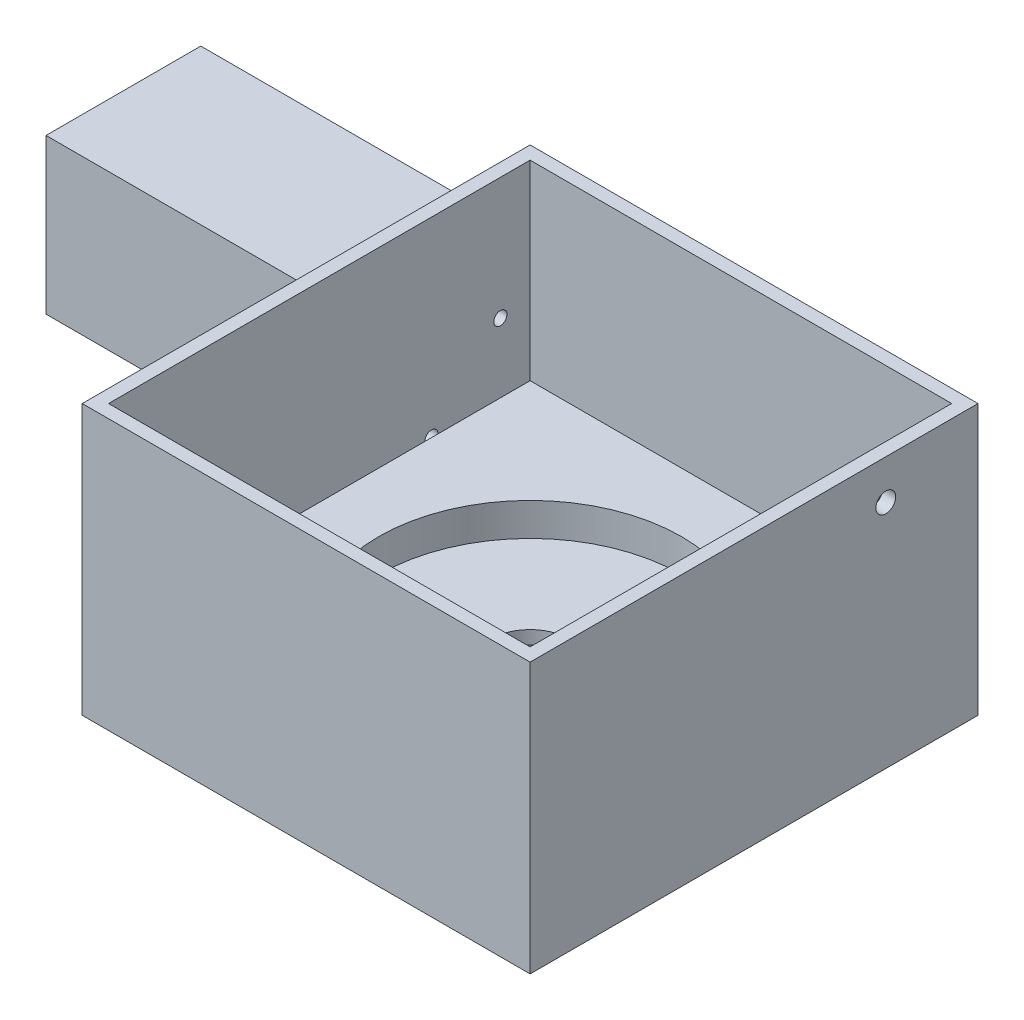
ISO-10303-21;
HEADER;
FILE_DESCRIPTION(('STEP AP214'),'2;1');
FILE_NAME('part.step','',(''),(''),'','','');
FILE_SCHEMA(('AUTOMOTIVE_DESIGN { 1 0 10303 214 1 1 1 1 }'));
ENDSEC;
DATA;
#1=APPLICATION_CONTEXT('core data for automotive mechanical design processes');
#2=APPLICATION_PROTOCOL_DEFINITION('international standard','automotive_design',2000,#1);
#3=PRODUCT_CONTEXT('',#1,'mechanical');
#4=PRODUCT('Part','Part','',(#3));
#5=PRODUCT_RELATED_PRODUCT_CATEGORY('part','',(#4));
#6=PRODUCT_DEFINITION_FORMATION('','',#4);
#7=PRODUCT_DEFINITION_CONTEXT('part definition',#1,'design');
#8=PRODUCT_DEFINITION('design','',#6,#7);
#9=PRODUCT_DEFINITION_SHAPE('','',#8);
#10=(LENGTH_UNIT() NAMED_UNIT(*) SI_UNIT(.MILLI.,.METRE.));
#11=(NAMED_UNIT(*) PLANE_ANGLE_UNIT() SI_UNIT($,.RADIAN.));
#12=(NAMED_UNIT(*) SI_UNIT($,.STERADIAN.) SOLID_ANGLE_UNIT());
#13=UNCERTAINTY_MEASURE_WITH_UNIT(LENGTH_MEASURE(1.E-05),#10,'distance_accuracy_value','');
#14=(GEOMETRIC_REPRESENTATION_CONTEXT(3) GLOBAL_UNCERTAINTY_ASSIGNED_CONTEXT((#13)) GLOBAL_UNIT_ASSIGNED_CONTEXT((#10,
#11,#12)) REPRESENTATION_CONTEXT('',''));
#15=CARTESIAN_POINT('',(0.,0.,0.));
#16=DIRECTION('',(0.,0.,1.));
#17=DIRECTION('',(1.,0.,0.));
#18=AXIS2_PLACEMENT_3D('',#15,#16,#17);
#19=CARTESIAN_POINT('',(0.,0.,0.));
#20=DIRECTION('',(0.,-1.,0.));
#21=DIRECTION('',(0.,0.,-1.));
#22=AXIS2_PLACEMENT_3D('',#19,#20,#21);
#23=PLANE('',#22);
#24=CARTESIAN_POINT('',(0.,0.,0.));
#25=DIRECTION('',(0.,-1.,0.));
#26=DIRECTION('',(0.,0.,-1.));
#27=AXIS2_PLACEMENT_3D('',#24,#25,#26);
#28=CIRCLE('',#27,10.5);
#29=CARTESIAN_POINT('',(0.,0.,-10.5));
#30=VERTEX_POINT('',#29);
#31=EDGE_CURVE('E237',#30,#30,#28,.T.);
#32=ORIENTED_EDGE('',*,*,#31,.F.);
#33=EDGE_LOOP('',(#32));
#34=FACE_BOUND('',#33,.T.);
#35=DIRECTION('',(1.,0.,0.));
#36=VECTOR('',#35,1.);
#37=CARTESIAN_POINT('',(13.,0.,-13.));
#38=LINE('',#37,#36);
#39=CARTESIAN_POINT('',(-13.,0.,-13.));
#40=VERTEX_POINT('',#39);
#41=CARTESIAN_POINT('',(13.,0.,-13.));
#42=VERTEX_POINT('',#41);
#43=EDGE_CURVE('E303',#40,#42,#38,.T.);
#44=ORIENTED_EDGE('',*,*,#43,.T.);
#45=DIRECTION('',(0.,0.,1.));
#46=VECTOR('',#45,1.);
#47=CARTESIAN_POINT('',(13.,0.,-13.));
#48=LINE('',#47,#46);
#49=CARTESIAN_POINT('',(13.,0.,13.));
#50=VERTEX_POINT('',#49);
#51=EDGE_CURVE('E316',#42,#50,#48,.T.);
#52=ORIENTED_EDGE('',*,*,#51,.T.);
#53=DIRECTION('',(-1.,0.,0.));
#54=VECTOR('',#53,1.);
#55=CARTESIAN_POINT('',(13.,0.,13.));
#56=LINE('',#55,#54);
#57=CARTESIAN_POINT('',(-13.,0.,13.));
#58=VERTEX_POINT('',#57);
#59=EDGE_CURVE('E312',#50,#58,#56,.T.);
#60=ORIENTED_EDGE('',*,*,#59,.T.);
#61=DIRECTION('',(0.,0.,-1.));
#62=VECTOR('',#61,1.);
#63=CARTESIAN_POINT('',(-13.,0.,-13.));
#64=LINE('',#63,#62);
#65=EDGE_CURVE('E308',#58,#40,#64,.T.);
#66=ORIENTED_EDGE('',*,*,#65,.T.);
#67=EDGE_LOOP('',(#44,#52,#60,#66));
#68=FACE_BOUND('',#67,.T.);
#69=ADVANCED_FACE('F39',(#34,#68),#23,.T.);
#70=CARTESIAN_POINT('',(0.,0.,0.));
#71=DIRECTION('',(0.,1.,0.));
#72=DIRECTION('',(0.,0.,1.));
#73=AXIS2_PLACEMENT_3D('',#70,#71,#72);
#74=CYLINDRICAL_SURFACE('',#73,6.05);
#75=CARTESIAN_POINT('',(0.,7.,0.));
#76=DIRECTION('',(0.,1.,0.));
#77=DIRECTION('',(0.,0.,1.));
#78=AXIS2_PLACEMENT_3D('',#75,#76,#77);
#79=CIRCLE('',#78,6.05);
#80=CARTESIAN_POINT('',(0.,7.,6.05));
#81=VERTEX_POINT('',#80);
#82=EDGE_CURVE('E229',#81,#81,#79,.T.);
#83=ORIENTED_EDGE('',*,*,#82,.T.);
#84=EDGE_LOOP('',(#83));
#85=FACE_BOUND('',#84,.T.);
#86=CARTESIAN_POINT('',(0.,5.,0.));
#87=DIRECTION('',(0.,-1.,0.));
#88=DIRECTION('',(0.,0.,-1.));
#89=AXIS2_PLACEMENT_3D('',#86,#87,#88);
#90=CIRCLE('',#89,6.05);
#91=CARTESIAN_POINT('',(0.,5.,-6.05));
#92=VERTEX_POINT('',#91);
#93=EDGE_CURVE('E43',#92,#92,#90,.F.);
#94=ORIENTED_EDGE('',*,*,#93,.F.);
#95=EDGE_LOOP('',(#94));
#96=FACE_BOUND('',#95,.T.);
#97=ADVANCED_FACE('F439',(#85,#96),#74,.F.);
#98=CARTESIAN_POINT('',(34.,41.,34.));
#99=DIRECTION('',(-1.,0.,0.));
#100=DIRECTION('',(0.,0.,1.));
#101=AXIS2_PLACEMENT_3D('',#98,#99,#100);
#102=PLANE('',#101);
#103=CARTESIAN_POINT('',(34.,35.,-20.));
#104=DIRECTION('',(-1.,0.,0.));
#105=DIRECTION('',(0.,0.,1.));
#106=AXIS2_PLACEMENT_3D('',#103,#104,#105);
#107=CIRCLE('',#106,1.5);
#108=CARTESIAN_POINT('',(34.,35.,-18.5));
#109=VERTEX_POINT('',#108);
#110=EDGE_CURVE('E320',#109,#109,#107,.T.);
#111=ORIENTED_EDGE('',*,*,#110,.T.);
#112=EDGE_LOOP('',(#111));
#113=FACE_BOUND('',#112,.T.);
#114=DIRECTION('',(0.,0.,-1.));
#115=VECTOR('',#114,1.);
#116=CARTESIAN_POINT('',(34.,0.,34.));
#117=LINE('',#116,#115);
#118=CARTESIAN_POINT('',(34.,0.,34.));
#119=VERTEX_POINT('',#118);
#120=CARTESIAN_POINT('',(34.,0.,-34.));
#121=VERTEX_POINT('',#120);
#122=EDGE_CURVE('E470',#119,#121,#117,.T.);
#123=ORIENTED_EDGE('',*,*,#122,.T.);
#124=DIRECTION('',(0.,-1.,0.));
#125=VECTOR('',#124,1.);
#126=CARTESIAN_POINT('',(34.,41.,-34.));
#127=LINE('',#126,#125);
#128=CARTESIAN_POINT('',(34.,41.,-34.));
#129=VERTEX_POINT('',#128);
#130=EDGE_CURVE('E11',#129,#121,#127,.T.);
#131=ORIENTED_EDGE('',*,*,#130,.F.);
#132=DIRECTION('',(0.,0.,-1.));
#133=VECTOR('',#132,1.);
#134=CARTESIAN_POINT('',(34.,41.,34.));
#135=LINE('',#134,#133);
#136=CARTESIAN_POINT('',(34.,41.,34.));
#137=VERTEX_POINT('',#136);
#138=EDGE_CURVE('E495',#137,#129,#135,.T.);
#139=ORIENTED_EDGE('',*,*,#138,.F.);
#140=DIRECTION('',(0.,-1.,0.));
#141=VECTOR('',#140,1.);
#142=CARTESIAN_POINT('',(34.,41.,34.));
#143=LINE('',#142,#141);
#144=EDGE_CURVE('E496',#137,#119,#143,.T.);
#145=ORIENTED_EDGE('',*,*,#144,.T.);
#146=EDGE_LOOP('',(#123,#131,#139,#145));
#147=FACE_BOUND('',#146,.T.);
#148=ADVANCED_FACE('F41',(#113,#147),#102,.F.);
#149=CARTESIAN_POINT('',(-34.,41.,-34.));
#150=DIRECTION('',(0.,0.,1.));
#151=DIRECTION('',(1.,0.,0.));
#152=AXIS2_PLACEMENT_3D('',#149,#150,#151);
#153=PLANE('',#152);
#154=DIRECTION('',(-1.,0.,0.));
#155=VECTOR('',#154,1.);
#156=CARTESIAN_POINT('',(-34.,0.,-34.));
#157=LINE('',#156,#155);
#158=CARTESIAN_POINT('',(-34.,0.,-34.));
#159=VERTEX_POINT('',#158);
#160=EDGE_CURVE('E474',#121,#159,#157,.T.);
#161=ORIENTED_EDGE('',*,*,#160,.T.);
#162=DIRECTION('',(0.,-1.,0.));
#163=VECTOR('',#162,1.);
#164=CARTESIAN_POINT('',(-34.,41.,-34.));
#165=LINE('',#164,#163);
#166=CARTESIAN_POINT('',(-34.,5.5,-34.));
#167=VERTEX_POINT('',#166);
#168=EDGE_CURVE('E503',#167,#159,#165,.T.);
#169=ORIENTED_EDGE('',*,*,#168,.F.);
#170=DIRECTION('',(1.,0.,0.));
#171=VECTOR('',#170,1.);
#172=CARTESIAN_POINT('',(-84.,5.5,-34.));
#173=LINE('',#172,#171);
#174=CARTESIAN_POINT('',(-84.,5.5,-34.));
#175=VERTEX_POINT('',#174);
#176=EDGE_CURVE('E339',#175,#167,#173,.T.);
#177=ORIENTED_EDGE('',*,*,#176,.F.);
#178=DIRECTION('',(0.,-1.,0.));
#179=VECTOR('',#178,1.);
#180=CARTESIAN_POINT('',(-84.,5.5,-34.));
#181=LINE('',#180,#179);
#182=CARTESIAN_POINT('',(-84.,29.,-34.));
#183=VERTEX_POINT('',#182);
#184=EDGE_CURVE('E361',#183,#175,#181,.T.);
#185=ORIENTED_EDGE('',*,*,#184,.F.);
#186=DIRECTION('',(1.,0.,0.));
#187=VECTOR('',#186,1.);
#188=CARTESIAN_POINT('',(-84.,29.,-34.));
#189=LINE('',#188,#187);
#190=CARTESIAN_POINT('',(-34.,29.,-34.));
#191=VERTEX_POINT('',#190);
#192=EDGE_CURVE('E354',#183,#191,#189,.T.);
#193=ORIENTED_EDGE('',*,*,#192,.T.);
#194=CARTESIAN_POINT('',(-34.,41.,-34.));
#195=VERTEX_POINT('',#194);
#196=EDGE_CURVE('E49',#195,#191,#165,.T.);
#197=ORIENTED_EDGE('',*,*,#196,.F.);
#198=DIRECTION('',(-1.,0.,0.));
#199=VECTOR('',#198,1.);
#200=CARTESIAN_POINT('',(-34.,41.,-34.));
#201=LINE('',#200,#199);
#202=EDGE_CURVE('E511',#129,#195,#201,.T.);
#203=ORIENTED_EDGE('',*,*,#202,.F.);
#204=ORIENTED_EDGE('',*,*,#130,.T.);
#205=EDGE_LOOP('',(#161,#169,#177,#185,#193,#197,#203,#204));
#206=FACE_BOUND('',#205,.T.);
#207=ADVANCED_FACE('F437',(#206),#153,.F.);
#208=CARTESIAN_POINT('',(-34.,41.,34.));
#209=DIRECTION('',(1.,0.,0.));
#210=DIRECTION('',(0.,0.,-1.));
#211=AXIS2_PLACEMENT_3D('',#208,#209,#210);
#212=PLANE('',#211);
#213=DIRECTION('',(0.,0.,-1.));
#214=VECTOR('',#213,1.);
#215=CARTESIAN_POINT('',(-34.,29.,-34.));
#216=LINE('',#215,#214);
#217=CARTESIAN_POINT('',(-34.,29.,-10.5));
#218=VERTEX_POINT('',#217);
#219=EDGE_CURVE('E63',#218,#191,#216,.T.);
#220=ORIENTED_EDGE('',*,*,#219,.F.);
#221=DIRECTION('',(0.,1.,0.));
#222=VECTOR('',#221,1.);
#223=CARTESIAN_POINT('',(-34.,5.5,-10.5));
#224=LINE('',#223,#222);
#225=CARTESIAN_POINT('',(-34.,5.5,-10.5));
#226=VERTEX_POINT('',#225);
#227=EDGE_CURVE('E362',#226,#218,#224,.T.);
#228=ORIENTED_EDGE('',*,*,#227,.F.);
#229=DIRECTION('',(0.,0.,1.));
#230=VECTOR('',#229,1.);
#231=CARTESIAN_POINT('',(-34.,5.5,-34.));
#232=LINE('',#231,#230);
#233=EDGE_CURVE('E365',#167,#226,#232,.T.);
#234=ORIENTED_EDGE('',*,*,#233,.F.);
#235=ORIENTED_EDGE('',*,*,#168,.T.);
#236=DIRECTION('',(0.,0.,1.));
#237=VECTOR('',#236,1.);
#238=CARTESIAN_POINT('',(-34.,0.,34.));
#239=LINE('',#238,#237);
#240=CARTESIAN_POINT('',(-34.,0.,34.));
#241=VERTEX_POINT('',#240);
#242=EDGE_CURVE('E483',#159,#241,#239,.T.);
#243=ORIENTED_EDGE('',*,*,#242,.T.);
#244=DIRECTION('',(0.,-1.,0.));
#245=VECTOR('',#244,1.);
#246=CARTESIAN_POINT('',(-34.,41.,34.));
#247=LINE('',#246,#245);
#248=CARTESIAN_POINT('',(-34.,41.,34.));
#249=VERTEX_POINT('',#248);
#250=EDGE_CURVE('E499',#249,#241,#247,.T.);
#251=ORIENTED_EDGE('',*,*,#250,.F.);
#252=DIRECTION('',(0.,0.,1.));
#253=VECTOR('',#252,1.);
#254=CARTESIAN_POINT('',(-34.,41.,34.));
#255=LINE('',#254,#253);
#256=EDGE_CURVE('E519',#195,#249,#255,.T.);
#257=ORIENTED_EDGE('',*,*,#256,.F.);
#258=ORIENTED_EDGE('',*,*,#196,.T.);
#259=EDGE_LOOP('',(#220,#228,#234,#235,#243,#251,#257,#258));
#260=FACE_BOUND('',#259,.T.);
#261=ADVANCED_FACE('F429',(#260),#212,.F.);
#262=CARTESIAN_POINT('',(-34.,41.,34.));
#263=DIRECTION('',(0.,0.,-1.));
#264=DIRECTION('',(-1.,0.,0.));
#265=AXIS2_PLACEMENT_3D('',#262,#263,#264);
#266=PLANE('',#265);
#267=DIRECTION('',(1.,0.,0.));
#268=VECTOR('',#267,1.);
#269=CARTESIAN_POINT('',(-34.,0.,34.));
#270=LINE('',#269,#268);
#271=EDGE_CURVE('E472',#241,#119,#270,.T.);
#272=ORIENTED_EDGE('',*,*,#271,.T.);
#273=ORIENTED_EDGE('',*,*,#144,.F.);
#274=DIRECTION('',(1.,0.,0.));
#275=VECTOR('',#274,1.);
#276=CARTESIAN_POINT('',(-34.,41.,34.));
#277=LINE('',#276,#275);
#278=EDGE_CURVE('E488',#249,#137,#277,.T.);
#279=ORIENTED_EDGE('',*,*,#278,.F.);
#280=ORIENTED_EDGE('',*,*,#250,.T.);
#281=EDGE_LOOP('',(#272,#273,#279,#280));
#282=FACE_BOUND('',#281,.T.);
#283=ADVANCED_FACE('F436',(#282),#266,.F.);
#284=CARTESIAN_POINT('',(0.,41.,0.));
#285=DIRECTION('',(0.,-1.,0.));
#286=DIRECTION('',(0.,0.,-1.));
#287=AXIS2_PLACEMENT_3D('',#284,#285,#286);
#288=PLANE('',#287);
#289=DIRECTION('',(-1.,0.,0.));
#290=VECTOR('',#289,1.);
#291=CARTESIAN_POINT('',(0.,41.,-32.));
#292=LINE('',#291,#290);
#293=CARTESIAN_POINT('',(32.,41.,-32.));
#294=VERTEX_POINT('',#293);
#295=CARTESIAN_POINT('',(-32.,41.,-32.));
#296=VERTEX_POINT('',#295);
#297=EDGE_CURVE('E841',#294,#296,#292,.T.);
#298=ORIENTED_EDGE('',*,*,#297,.F.);
#299=DIRECTION('',(0.,0.,-1.));
#300=VECTOR('',#299,1.);
#301=CARTESIAN_POINT('',(32.,41.,0.));
#302=LINE('',#301,#300);
#303=CARTESIAN_POINT('',(32.,41.,32.));
#304=VERTEX_POINT('',#303);
#305=EDGE_CURVE('E233',#304,#294,#302,.T.);
#306=ORIENTED_EDGE('',*,*,#305,.F.);
#307=DIRECTION('',(1.,0.,0.));
#308=VECTOR('',#307,1.);
#309=CARTESIAN_POINT('',(0.,41.,32.));
#310=LINE('',#309,#308);
#311=CARTESIAN_POINT('',(-32.,41.,32.));
#312=VERTEX_POINT('',#311);
#313=EDGE_CURVE('E221',#312,#304,#310,.T.);
#314=ORIENTED_EDGE('',*,*,#313,.F.);
#315=DIRECTION('',(0.,0.,1.));
#316=VECTOR('',#315,1.);
#317=CARTESIAN_POINT('',(-32.,41.,0.));
#318=LINE('',#317,#316);
#319=EDGE_CURVE('E848',#296,#312,#318,.T.);
#320=ORIENTED_EDGE('',*,*,#319,.F.);
#321=EDGE_LOOP('',(#298,#306,#314,#320));
#322=FACE_BOUND('',#321,.T.);
#323=ORIENTED_EDGE('',*,*,#138,.T.);
#324=ORIENTED_EDGE('',*,*,#202,.T.);
#325=ORIENTED_EDGE('',*,*,#256,.T.);
#326=ORIENTED_EDGE('',*,*,#278,.T.);
#327=EDGE_LOOP('',(#323,#324,#325,#326));
#328=FACE_BOUND('',#327,.T.);
#329=ADVANCED_FACE('F453',(#322,#328),#288,.F.);
#330=DIRECTION('',(0.,0.,1.));
#331=VECTOR('',#330,1.);
#332=CARTESIAN_POINT('',(15.,0.,-15.));
#333=LINE('',#332,#331);
#334=CARTESIAN_POINT('',(15.,0.,-15.));
#335=VERTEX_POINT('',#334);
#336=CARTESIAN_POINT('',(15.,0.,15.));
#337=VERTEX_POINT('',#336);
#338=EDGE_CURVE('E272',#335,#337,#333,.T.);
#339=ORIENTED_EDGE('',*,*,#338,.F.);
#340=DIRECTION('',(1.,0.,0.));
#341=VECTOR('',#340,1.);
#342=CARTESIAN_POINT('',(15.,0.,-15.));
#343=LINE('',#342,#341);
#344=CARTESIAN_POINT('',(-15.,0.,-15.));
#345=VERTEX_POINT('',#344);
#346=EDGE_CURVE('E259',#345,#335,#343,.T.);
#347=ORIENTED_EDGE('',*,*,#346,.F.);
#348=DIRECTION('',(0.,0.,-1.));
#349=VECTOR('',#348,1.);
#350=CARTESIAN_POINT('',(-15.,0.,-15.));
#351=LINE('',#350,#349);
#352=CARTESIAN_POINT('',(-15.,0.,15.));
#353=VERTEX_POINT('',#352);
#354=EDGE_CURVE('E264',#353,#345,#351,.T.);
#355=ORIENTED_EDGE('',*,*,#354,.F.);
#356=DIRECTION('',(-1.,0.,0.));
#357=VECTOR('',#356,1.);
#358=CARTESIAN_POINT('',(15.,0.,15.));
#359=LINE('',#358,#357);
#360=EDGE_CURVE('E268',#337,#353,#359,.T.);
#361=ORIENTED_EDGE('',*,*,#360,.F.);
#362=EDGE_LOOP('',(#339,#347,#355,#361));
#363=FACE_BOUND('',#362,.T.);
#364=ORIENTED_EDGE('',*,*,#122,.F.);
#365=ORIENTED_EDGE('',*,*,#271,.F.);
#366=ORIENTED_EDGE('',*,*,#242,.F.);
#367=ORIENTED_EDGE('',*,*,#160,.F.);
#368=EDGE_LOOP('',(#364,#365,#366,#367));
#369=FACE_BOUND('',#368,.T.);
#370=ADVANCED_FACE('F442',(#363,#369),#23,.T.);
#371=CARTESIAN_POINT('',(32.,12.,0.));
#372=DIRECTION('',(1.,0.,0.));
#373=DIRECTION('',(0.,0.,-1.));
#374=AXIS2_PLACEMENT_3D('',#371,#372,#373);
#375=PLANE('',#374);
#376=CARTESIAN_POINT('',(32.,35.,-20.));
#377=DIRECTION('',(-1.,0.,0.));
#378=DIRECTION('',(0.,0.,1.));
#379=AXIS2_PLACEMENT_3D('',#376,#377,#378);
#380=CIRCLE('',#379,1.5);
#381=CARTESIAN_POINT('',(32.,35.,-18.5));
#382=VERTEX_POINT('',#381);
#383=EDGE_CURVE('E335',#382,#382,#380,.T.);
#384=ORIENTED_EDGE('',*,*,#383,.F.);
#385=EDGE_LOOP('',(#384));
#386=FACE_BOUND('',#385,.T.);
#387=ORIENTED_EDGE('',*,*,#305,.T.);
#388=DIRECTION('',(0.,1.,0.));
#389=VECTOR('',#388,1.);
#390=CARTESIAN_POINT('',(32.,12.,-32.));
#391=LINE('',#390,#389);
#392=CARTESIAN_POINT('',(32.,12.,-32.));
#393=VERTEX_POINT('',#392);
#394=EDGE_CURVE('E214',#393,#294,#391,.T.);
#395=ORIENTED_EDGE('',*,*,#394,.F.);
#396=DIRECTION('',(0.,0.,-1.));
#397=VECTOR('',#396,1.);
#398=CARTESIAN_POINT('',(32.,12.,0.));
#399=LINE('',#398,#397);
#400=CARTESIAN_POINT('',(32.,12.,32.));
#401=VERTEX_POINT('',#400);
#402=EDGE_CURVE('E219',#401,#393,#399,.T.);
#403=ORIENTED_EDGE('',*,*,#402,.F.);
#404=DIRECTION('',(0.,1.,0.));
#405=VECTOR('',#404,1.);
#406=CARTESIAN_POINT('',(32.,12.,32.));
#407=LINE('',#406,#405);
#408=EDGE_CURVE('E479',#401,#304,#407,.T.);
#409=ORIENTED_EDGE('',*,*,#408,.T.);
#410=EDGE_LOOP('',(#387,#395,#403,#409));
#411=FACE_BOUND('',#410,.T.);
#412=ADVANCED_FACE('F452',(#386,#411),#375,.F.);
#413=CARTESIAN_POINT('',(0.,12.,32.));
#414=DIRECTION('',(0.,0.,1.));
#415=DIRECTION('',(1.,0.,0.));
#416=AXIS2_PLACEMENT_3D('',#413,#414,#415);
#417=PLANE('',#416);
#418=ORIENTED_EDGE('',*,*,#313,.T.);
#419=ORIENTED_EDGE('',*,*,#408,.F.);
#420=DIRECTION('',(1.,0.,0.));
#421=VECTOR('',#420,1.);
#422=CARTESIAN_POINT('',(0.,12.,32.));
#423=LINE('',#422,#421);
#424=CARTESIAN_POINT('',(-32.,12.,32.));
#425=VERTEX_POINT('',#424);
#426=EDGE_CURVE('E211',#425,#401,#423,.T.);
#427=ORIENTED_EDGE('',*,*,#426,.F.);
#428=DIRECTION('',(0.,1.,0.));
#429=VECTOR('',#428,1.);
#430=CARTESIAN_POINT('',(-32.,12.,32.));
#431=LINE('',#430,#429);
#432=EDGE_CURVE('E485',#425,#312,#431,.T.);
#433=ORIENTED_EDGE('',*,*,#432,.T.);
#434=EDGE_LOOP('',(#418,#419,#427,#433));
#435=FACE_BOUND('',#434,.T.);
#436=ADVANCED_FACE('F459',(#435),#417,.F.);
#437=CARTESIAN_POINT('',(-32.,12.,0.));
#438=DIRECTION('',(-1.,0.,0.));
#439=DIRECTION('',(0.,0.,1.));
#440=AXIS2_PLACEMENT_3D('',#437,#438,#439);
#441=PLANE('',#440);
#442=CARTESIAN_POINT('',(-32.,22.4825901807804,-27.4825901807805));
#443=DIRECTION('',(-1.,0.,0.));
#444=DIRECTION('',(0.,0.,1.));
#445=AXIS2_PLACEMENT_3D('',#442,#443,#444);
#446=CIRCLE('',#445,1.);
#447=CARTESIAN_POINT('',(-32.,22.4825901807804,-26.4825901807805));
#448=VERTEX_POINT('',#447);
#449=EDGE_CURVE('E385',#448,#448,#446,.T.);
#450=ORIENTED_EDGE('',*,*,#449,.T.);
#451=EDGE_LOOP('',(#450));
#452=FACE_BOUND('',#451,.T.);
#453=DIRECTION('',(0.,0.,1.));
#454=VECTOR('',#453,1.);
#455=CARTESIAN_POINT('',(-32.,12.,0.));
#456=LINE('',#455,#454);
#457=CARTESIAN_POINT('',(-32.,12.,-16.0175613816078));
#458=VERTEX_POINT('',#457);
#459=EDGE_CURVE('E188',#458,#425,#456,.T.);
#460=ORIENTED_EDGE('',*,*,#459,.F.);
#461=CARTESIAN_POINT('',(-32.,12.0174098192195,-17.0174098192196));
#462=DIRECTION('',(-1.,0.,0.));
#463=DIRECTION('',(0.,0.,-1.));
#464=AXIS2_PLACEMENT_3D('',#461,#462,#463);
#465=CIRCLE('',#464,1.);
#466=CARTESIAN_POINT('',(-32.,12.,-18.0172582568314));
#467=VERTEX_POINT('',#466);
#468=EDGE_CURVE('E194',#458,#467,#465,.T.);
#469=ORIENTED_EDGE('',*,*,#468,.T.);
#470=CARTESIAN_POINT('',(-32.,12.,-32.));
#471=VERTEX_POINT('',#470);
#472=EDGE_CURVE('E187',#471,#467,#456,.T.);
#473=ORIENTED_EDGE('',*,*,#472,.F.);
#474=DIRECTION('',(0.,1.,0.));
#475=VECTOR('',#474,1.);
#476=CARTESIAN_POINT('',(-32.,12.,-32.));
#477=LINE('',#476,#475);
#478=EDGE_CURVE('E846',#471,#296,#477,.T.);
#479=ORIENTED_EDGE('',*,*,#478,.T.);
#480=ORIENTED_EDGE('',*,*,#319,.T.);
#481=ORIENTED_EDGE('',*,*,#432,.F.);
#482=EDGE_LOOP('',(#460,#469,#473,#479,#480,#481));
#483=FACE_BOUND('',#482,.T.);
#484=ADVANCED_FACE('F201',(#452,#483),#441,.F.);
#485=CARTESIAN_POINT('',(0.,12.,-32.));
#486=DIRECTION('',(0.,0.,-1.));
#487=DIRECTION('',(-1.,0.,0.));
#488=AXIS2_PLACEMENT_3D('',#485,#486,#487);
#489=PLANE('',#488);
#490=ORIENTED_EDGE('',*,*,#297,.T.);
#491=ORIENTED_EDGE('',*,*,#478,.F.);
#492=DIRECTION('',(-1.,0.,0.));
#493=VECTOR('',#492,1.);
#494=CARTESIAN_POINT('',(0.,12.,-32.));
#495=LINE('',#494,#493);
#496=EDGE_CURVE('E209',#393,#471,#495,.T.);
#497=ORIENTED_EDGE('',*,*,#496,.F.);
#498=ORIENTED_EDGE('',*,*,#394,.T.);
#499=EDGE_LOOP('',(#490,#491,#497,#498));
#500=FACE_BOUND('',#499,.T.);
#501=ADVANCED_FACE('F555',(#500),#489,.F.);
#502=CARTESIAN_POINT('',(0.,12.,0.));
#503=DIRECTION('',(0.,1.,0.));
#504=DIRECTION('',(0.,0.,1.));
#505=AXIS2_PLACEMENT_3D('',#502,#503,#504);
#506=PLANE('',#505);
#507=CARTESIAN_POINT('',(0.,12.,0.));
#508=DIRECTION('',(0.,1.,0.));
#509=DIRECTION('',(0.,0.,1.));
#510=AXIS2_PLACEMENT_3D('',#507,#508,#509);
#511=CIRCLE('',#510,23.);
#512=CARTESIAN_POINT('',(0.,12.,23.));
#513=VERTEX_POINT('',#512);
#514=EDGE_CURVE('E224',#513,#513,#511,.T.);
#515=ORIENTED_EDGE('',*,*,#514,.F.);
#516=EDGE_LOOP('',(#515));
#517=FACE_BOUND('',#516,.T.);
#518=ORIENTED_EDGE('',*,*,#402,.T.);
#519=ORIENTED_EDGE('',*,*,#496,.T.);
#520=ORIENTED_EDGE('',*,*,#472,.T.);
#521=EDGE_CURVE('E182',#467,#458,#456,.T.);
#522=ORIENTED_EDGE('',*,*,#521,.T.);
#523=ORIENTED_EDGE('',*,*,#459,.T.);
#524=ORIENTED_EDGE('',*,*,#426,.T.);
#525=EDGE_LOOP('',(#518,#519,#520,#522,#523,#524));
#526=FACE_BOUND('',#525,.T.);
#527=ADVANCED_FACE('F207',(#517,#526),#506,.T.);
#528=CARTESIAN_POINT('',(0.,7.,0.));
#529=DIRECTION('',(0.,1.,0.));
#530=DIRECTION('',(0.,0.,1.));
#531=AXIS2_PLACEMENT_3D('',#528,#529,#530);
#532=CYLINDRICAL_SURFACE('',#531,23.);
#533=CARTESIAN_POINT('',(0.,7.,0.));
#534=DIRECTION('',(0.,1.,0.));
#535=DIRECTION('',(0.,0.,1.));
#536=AXIS2_PLACEMENT_3D('',#533,#534,#535);
#537=CIRCLE('',#536,23.);
#538=CARTESIAN_POINT('',(0.,7.,23.));
#539=VERTEX_POINT('',#538);
#540=EDGE_CURVE('E228',#539,#539,#537,.T.);
#541=ORIENTED_EDGE('',*,*,#540,.F.);
#542=EDGE_LOOP('',(#541));
#543=FACE_BOUND('',#542,.T.);
#544=ORIENTED_EDGE('',*,*,#514,.T.);
#545=EDGE_LOOP('',(#544));
#546=FACE_BOUND('',#545,.T.);
#547=ADVANCED_FACE('F567',(#543,#546),#532,.F.);
#548=CARTESIAN_POINT('',(0.,7.,0.));
#549=DIRECTION('',(0.,1.,0.));
#550=DIRECTION('',(0.,0.,1.));
#551=AXIS2_PLACEMENT_3D('',#548,#549,#550);
#552=PLANE('',#551);
#553=ORIENTED_EDGE('',*,*,#82,.F.);
#554=EDGE_LOOP('',(#553));
#555=FACE_BOUND('',#554,.T.);
#556=ORIENTED_EDGE('',*,*,#540,.T.);
#557=EDGE_LOOP('',(#556));
#558=FACE_BOUND('',#557,.T.);
#559=ADVANCED_FACE('F572',(#555,#558),#552,.T.);
#560=CARTESIAN_POINT('',(0.,5.,0.));
#561=DIRECTION('',(0.,-1.,0.));
#562=DIRECTION('',(0.,0.,-1.));
#563=AXIS2_PLACEMENT_3D('',#560,#561,#562);
#564=PLANE('',#563);
#565=CARTESIAN_POINT('',(0.,5.,0.));
#566=DIRECTION('',(0.,-1.,0.));
#567=DIRECTION('',(0.,0.,-1.));
#568=AXIS2_PLACEMENT_3D('',#565,#566,#567);
#569=CIRCLE('',#568,10.5);
#570=CARTESIAN_POINT('',(0.,5.,-10.5));
#571=VERTEX_POINT('',#570);
#572=EDGE_CURVE('E241',#571,#571,#569,.T.);
#573=ORIENTED_EDGE('',*,*,#572,.T.);
#574=EDGE_LOOP('',(#573));
#575=FACE_BOUND('',#574,.T.);
#576=ORIENTED_EDGE('',*,*,#93,.T.);
#577=EDGE_LOOP('',(#576));
#578=FACE_BOUND('',#577,.T.);
#579=ADVANCED_FACE('F582',(#575,#578),#564,.T.);
#580=CARTESIAN_POINT('',(0.,5.,0.));
#581=DIRECTION('',(0.,-1.,0.));
#582=DIRECTION('',(0.,0.,-1.));
#583=AXIS2_PLACEMENT_3D('',#580,#581,#582);
#584=CYLINDRICAL_SURFACE('',#583,10.5);
#585=ORIENTED_EDGE('',*,*,#572,.F.);
#586=EDGE_LOOP('',(#585));
#587=FACE_BOUND('',#586,.T.);
#588=ORIENTED_EDGE('',*,*,#31,.T.);
#589=EDGE_LOOP('',(#588));
#590=FACE_BOUND('',#589,.T.);
#591=ADVANCED_FACE('F599',(#587,#590),#584,.F.);
#592=CARTESIAN_POINT('',(15.,2.,-15.));
#593=DIRECTION('',(1.,0.,0.));
#594=DIRECTION('',(0.,0.,-1.));
#595=AXIS2_PLACEMENT_3D('',#592,#593,#594);
#596=PLANE('',#595);
#597=ORIENTED_EDGE('',*,*,#338,.T.);
#598=DIRECTION('',(0.,-1.,0.));
#599=VECTOR('',#598,1.);
#600=CARTESIAN_POINT('',(15.,2.,15.));
#601=LINE('',#600,#599);
#602=CARTESIAN_POINT('',(15.,2.,15.));
#603=VERTEX_POINT('',#602);
#604=EDGE_CURVE('E246',#603,#337,#601,.T.);
#605=ORIENTED_EDGE('',*,*,#604,.F.);
#606=DIRECTION('',(0.,0.,1.));
#607=VECTOR('',#606,1.);
#608=CARTESIAN_POINT('',(15.,2.,-15.));
#609=LINE('',#608,#607);
#610=CARTESIAN_POINT('',(15.,2.,-15.));
#611=VERTEX_POINT('',#610);
#612=EDGE_CURVE('E263',#611,#603,#609,.T.);
#613=ORIENTED_EDGE('',*,*,#612,.F.);
#614=DIRECTION('',(0.,-1.,0.));
#615=VECTOR('',#614,1.);
#616=CARTESIAN_POINT('',(15.,2.,-15.));
#617=LINE('',#616,#615);
#618=EDGE_CURVE('E242',#611,#335,#617,.T.);
#619=ORIENTED_EDGE('',*,*,#618,.T.);
#620=EDGE_LOOP('',(#597,#605,#613,#619));
#621=FACE_BOUND('',#620,.T.);
#622=ADVANCED_FACE('F608',(#621),#596,.F.);
#623=CARTESIAN_POINT('',(15.,2.,-15.));
#624=DIRECTION('',(0.,0.,-1.));
#625=DIRECTION('',(-1.,0.,0.));
#626=AXIS2_PLACEMENT_3D('',#623,#624,#625);
#627=PLANE('',#626);
#628=ORIENTED_EDGE('',*,*,#346,.T.);
#629=ORIENTED_EDGE('',*,*,#618,.F.);
#630=DIRECTION('',(1.,0.,0.));
#631=VECTOR('',#630,1.);
#632=CARTESIAN_POINT('',(15.,2.,-15.));
#633=LINE('',#632,#631);
#634=CARTESIAN_POINT('',(-15.,2.,-15.));
#635=VERTEX_POINT('',#634);
#636=EDGE_CURVE('E251',#635,#611,#633,.T.);
#637=ORIENTED_EDGE('',*,*,#636,.F.);
#638=DIRECTION('',(0.,-1.,0.));
#639=VECTOR('',#638,1.);
#640=CARTESIAN_POINT('',(-15.,2.,-15.));
#641=LINE('',#640,#639);
#642=EDGE_CURVE('E254',#635,#345,#641,.T.);
#643=ORIENTED_EDGE('',*,*,#642,.T.);
#644=EDGE_LOOP('',(#628,#629,#637,#643));
#645=FACE_BOUND('',#644,.T.);
#646=ADVANCED_FACE('F626',(#645),#627,.F.);
#647=CARTESIAN_POINT('',(-15.,2.,-15.));
#648=DIRECTION('',(-1.,0.,0.));
#649=DIRECTION('',(0.,0.,1.));
#650=AXIS2_PLACEMENT_3D('',#647,#648,#649);
#651=PLANE('',#650);
#652=ORIENTED_EDGE('',*,*,#354,.T.);
#653=ORIENTED_EDGE('',*,*,#642,.F.);
#654=DIRECTION('',(0.,0.,-1.));
#655=VECTOR('',#654,1.);
#656=CARTESIAN_POINT('',(-15.,2.,-15.));
#657=LINE('',#656,#655);
#658=CARTESIAN_POINT('',(-15.,2.,15.));
#659=VERTEX_POINT('',#658);
#660=EDGE_CURVE('E279',#659,#635,#657,.T.);
#661=ORIENTED_EDGE('',*,*,#660,.F.);
#662=DIRECTION('',(0.,-1.,0.));
#663=VECTOR('',#662,1.);
#664=CARTESIAN_POINT('',(-15.,2.,15.));
#665=LINE('',#664,#663);
#666=EDGE_CURVE('E250',#659,#353,#665,.T.);
#667=ORIENTED_EDGE('',*,*,#666,.T.);
#668=EDGE_LOOP('',(#652,#653,#661,#667));
#669=FACE_BOUND('',#668,.T.);
#670=ADVANCED_FACE('F636',(#669),#651,.F.);
#671=CARTESIAN_POINT('',(15.,2.,15.));
#672=DIRECTION('',(0.,0.,1.));
#673=DIRECTION('',(1.,0.,0.));
#674=AXIS2_PLACEMENT_3D('',#671,#672,#673);
#675=PLANE('',#674);
#676=ORIENTED_EDGE('',*,*,#360,.T.);
#677=ORIENTED_EDGE('',*,*,#666,.F.);
#678=DIRECTION('',(-1.,0.,0.));
#679=VECTOR('',#678,1.);
#680=CARTESIAN_POINT('',(15.,2.,15.));
#681=LINE('',#680,#679);
#682=EDGE_CURVE('E283',#603,#659,#681,.T.);
#683=ORIENTED_EDGE('',*,*,#682,.F.);
#684=ORIENTED_EDGE('',*,*,#604,.T.);
#685=EDGE_LOOP('',(#676,#677,#683,#684));
#686=FACE_BOUND('',#685,.T.);
#687=ADVANCED_FACE('F646',(#686),#675,.F.);
#688=CARTESIAN_POINT('',(0.,2.,0.));
#689=DIRECTION('',(0.,-1.,0.));
#690=DIRECTION('',(0.,0.,-1.));
#691=AXIS2_PLACEMENT_3D('',#688,#689,#690);
#692=PLANE('',#691);
#693=DIRECTION('',(1.,0.,0.));
#694=VECTOR('',#693,1.);
#695=CARTESIAN_POINT('',(13.,2.,-13.));
#696=LINE('',#695,#694);
#697=CARTESIAN_POINT('',(-13.,2.,-13.));
#698=VERTEX_POINT('',#697);
#699=CARTESIAN_POINT('',(13.,2.,-13.));
#700=VERTEX_POINT('',#699);
#701=EDGE_CURVE('E294',#698,#700,#696,.T.);
#702=ORIENTED_EDGE('',*,*,#701,.F.);
#703=DIRECTION('',(0.,0.,-1.));
#704=VECTOR('',#703,1.);
#705=CARTESIAN_POINT('',(-13.,2.,-13.));
#706=LINE('',#705,#704);
#707=CARTESIAN_POINT('',(-13.,2.,13.));
#708=VERTEX_POINT('',#707);
#709=EDGE_CURVE('E324',#708,#698,#706,.T.);
#710=ORIENTED_EDGE('',*,*,#709,.F.);
#711=DIRECTION('',(-1.,0.,0.));
#712=VECTOR('',#711,1.);
#713=CARTESIAN_POINT('',(13.,2.,13.));
#714=LINE('',#713,#712);
#715=CARTESIAN_POINT('',(13.,2.,13.));
#716=VERTEX_POINT('',#715);
#717=EDGE_CURVE('E328',#716,#708,#714,.T.);
#718=ORIENTED_EDGE('',*,*,#717,.F.);
#719=DIRECTION('',(0.,0.,1.));
#720=VECTOR('',#719,1.);
#721=CARTESIAN_POINT('',(13.,2.,-13.));
#722=LINE('',#721,#720);
#723=EDGE_CURVE('E307',#700,#716,#722,.T.);
#724=ORIENTED_EDGE('',*,*,#723,.F.);
#725=EDGE_LOOP('',(#702,#710,#718,#724));
#726=FACE_BOUND('',#725,.T.);
#727=ORIENTED_EDGE('',*,*,#612,.T.);
#728=ORIENTED_EDGE('',*,*,#682,.T.);
#729=ORIENTED_EDGE('',*,*,#660,.T.);
#730=ORIENTED_EDGE('',*,*,#636,.T.);
#731=EDGE_LOOP('',(#727,#728,#729,#730));
#732=FACE_BOUND('',#731,.T.);
#733=ADVANCED_FACE('F656',(#726,#732),#692,.T.);
#734=CARTESIAN_POINT('',(13.,2.,-13.));
#735=DIRECTION('',(1.,0.,0.));
#736=DIRECTION('',(0.,0.,-1.));
#737=AXIS2_PLACEMENT_3D('',#734,#735,#736);
#738=PLANE('',#737);
#739=ORIENTED_EDGE('',*,*,#51,.F.);
#740=DIRECTION('',(0.,-1.,0.));
#741=VECTOR('',#740,1.);
#742=CARTESIAN_POINT('',(13.,2.,-13.));
#743=LINE('',#742,#741);
#744=EDGE_CURVE('E275',#700,#42,#743,.T.);
#745=ORIENTED_EDGE('',*,*,#744,.F.);
#746=ORIENTED_EDGE('',*,*,#723,.T.);
#747=DIRECTION('',(0.,-1.,0.));
#748=VECTOR('',#747,1.);
#749=CARTESIAN_POINT('',(13.,2.,13.));
#750=LINE('',#749,#748);
#751=EDGE_CURVE('E290',#716,#50,#750,.T.);
#752=ORIENTED_EDGE('',*,*,#751,.T.);
#753=EDGE_LOOP('',(#739,#745,#746,#752));
#754=FACE_BOUND('',#753,.T.);
#755=ADVANCED_FACE('F666',(#754),#738,.T.);
#756=CARTESIAN_POINT('',(13.,2.,-13.));
#757=DIRECTION('',(0.,0.,-1.));
#758=DIRECTION('',(-1.,0.,0.));
#759=AXIS2_PLACEMENT_3D('',#756,#757,#758);
#760=PLANE('',#759);
#761=ORIENTED_EDGE('',*,*,#43,.F.);
#762=DIRECTION('',(0.,-1.,0.));
#763=VECTOR('',#762,1.);
#764=CARTESIAN_POINT('',(-13.,2.,-13.));
#765=LINE('',#764,#763);
#766=EDGE_CURVE('E298',#698,#40,#765,.T.);
#767=ORIENTED_EDGE('',*,*,#766,.F.);
#768=ORIENTED_EDGE('',*,*,#701,.T.);
#769=ORIENTED_EDGE('',*,*,#744,.T.);
#770=EDGE_LOOP('',(#761,#767,#768,#769));
#771=FACE_BOUND('',#770,.T.);
#772=ADVANCED_FACE('F676',(#771),#760,.T.);
#773=CARTESIAN_POINT('',(-13.,2.,-13.));
#774=DIRECTION('',(-1.,0.,0.));
#775=DIRECTION('',(0.,0.,1.));
#776=AXIS2_PLACEMENT_3D('',#773,#774,#775);
#777=PLANE('',#776);
#778=ORIENTED_EDGE('',*,*,#65,.F.);
#779=DIRECTION('',(0.,-1.,0.));
#780=VECTOR('',#779,1.);
#781=CARTESIAN_POINT('',(-13.,2.,13.));
#782=LINE('',#781,#780);
#783=EDGE_CURVE('E293',#708,#58,#782,.T.);
#784=ORIENTED_EDGE('',*,*,#783,.F.);
#785=ORIENTED_EDGE('',*,*,#709,.T.);
#786=ORIENTED_EDGE('',*,*,#766,.T.);
#787=EDGE_LOOP('',(#778,#784,#785,#786));
#788=FACE_BOUND('',#787,.T.);
#789=ADVANCED_FACE('F686',(#788),#777,.T.);
#790=CARTESIAN_POINT('',(13.,2.,13.));
#791=DIRECTION('',(0.,0.,1.));
#792=DIRECTION('',(1.,0.,0.));
#793=AXIS2_PLACEMENT_3D('',#790,#791,#792);
#794=PLANE('',#793);
#795=ORIENTED_EDGE('',*,*,#59,.F.);
#796=ORIENTED_EDGE('',*,*,#751,.F.);
#797=ORIENTED_EDGE('',*,*,#717,.T.);
#798=ORIENTED_EDGE('',*,*,#783,.T.);
#799=EDGE_LOOP('',(#795,#796,#797,#798));
#800=FACE_BOUND('',#799,.T.);
#801=ADVANCED_FACE('F696',(#800),#794,.T.);
#802=CARTESIAN_POINT('',(34.,35.,-20.));
#803=DIRECTION('',(-1.,0.,0.));
#804=DIRECTION('',(0.,0.,1.));
#805=AXIS2_PLACEMENT_3D('',#802,#803,#804);
#806=CYLINDRICAL_SURFACE('',#805,1.5);
#807=ORIENTED_EDGE('',*,*,#110,.F.);
#808=EDGE_LOOP('',(#807));
#809=FACE_BOUND('',#808,.T.);
#810=ORIENTED_EDGE('',*,*,#383,.T.);
#811=EDGE_LOOP('',(#810));
#812=FACE_BOUND('',#811,.T.);
#813=ADVANCED_FACE('F410',(#809,#812),#806,.F.);
#814=CARTESIAN_POINT('',(-84.,0.,0.));
#815=DIRECTION('',(1.,0.,0.));
#816=DIRECTION('',(0.,0.,-1.));
#817=AXIS2_PLACEMENT_3D('',#814,#815,#816);
#818=PLANE('',#817);
#819=CARTESIAN_POINT('',(-84.,22.4825901807804,-27.4825901807805));
#820=DIRECTION('',(-1.,0.,0.));
#821=DIRECTION('',(0.,0.,1.));
#822=AXIS2_PLACEMENT_3D('',#819,#820,#821);
#823=CIRCLE('',#822,1.);
#824=CARTESIAN_POINT('',(-84.,22.4825901807804,-26.4825901807805));
#825=VERTEX_POINT('',#824);
#826=EDGE_CURVE('E197',#825,#825,#823,.T.);
#827=ORIENTED_EDGE('',*,*,#826,.F.);
#828=EDGE_LOOP('',(#827));
#829=FACE_BOUND('',#828,.T.);
#830=CARTESIAN_POINT('',(-84.,12.0174098192195,-17.0174098192196));
#831=DIRECTION('',(-1.,0.,0.));
#832=DIRECTION('',(0.,0.,-1.));
#833=AXIS2_PLACEMENT_3D('',#830,#831,#832);
#834=CIRCLE('',#833,1.);
#835=CARTESIAN_POINT('',(-84.,12.0174098192195,-18.0174098192196));
#836=VERTEX_POINT('',#835);
#837=EDGE_CURVE('E205',#836,#836,#834,.T.);
#838=ORIENTED_EDGE('',*,*,#837,.F.);
#839=EDGE_LOOP('',(#838));
#840=FACE_BOUND('',#839,.T.);
#841=ORIENTED_EDGE('',*,*,#184,.T.);
#842=DIRECTION('',(0.,0.,1.));
#843=VECTOR('',#842,1.);
#844=CARTESIAN_POINT('',(-84.,5.5,-34.));
#845=LINE('',#844,#843);
#846=CARTESIAN_POINT('',(-84.,5.5,-10.5));
#847=VERTEX_POINT('',#846);
#848=EDGE_CURVE('E375',#175,#847,#845,.T.);
#849=ORIENTED_EDGE('',*,*,#848,.T.);
#850=DIRECTION('',(0.,1.,0.));
#851=VECTOR('',#850,1.);
#852=CARTESIAN_POINT('',(-84.,5.5,-10.5));
#853=LINE('',#852,#851);
#854=CARTESIAN_POINT('',(-84.,29.,-10.5));
#855=VERTEX_POINT('',#854);
#856=EDGE_CURVE('E372',#847,#855,#853,.T.);
#857=ORIENTED_EDGE('',*,*,#856,.T.);
#858=DIRECTION('',(0.,0.,-1.));
#859=VECTOR('',#858,1.);
#860=CARTESIAN_POINT('',(-84.,29.,-34.));
#861=LINE('',#860,#859);
#862=EDGE_CURVE('E358',#855,#183,#861,.T.);
#863=ORIENTED_EDGE('',*,*,#862,.T.);
#864=EDGE_LOOP('',(#841,#849,#857,#863));
#865=FACE_BOUND('',#864,.T.);
#866=CARTESIAN_POINT('',(-84.,17.25,-22.25));
#867=DIRECTION('',(-1.,0.,0.));
#868=DIRECTION('',(0.,0.,1.));
#869=AXIS2_PLACEMENT_3D('',#866,#867,#868);
#870=CIRCLE('',#869,5.6);
#871=CARTESIAN_POINT('',(-84.,17.25,-16.65));
#872=VERTEX_POINT('',#871);
#873=EDGE_CURVE('E369',#872,#872,#870,.T.);
#874=ORIENTED_EDGE('',*,*,#873,.F.);
#875=EDGE_LOOP('',(#874));
#876=FACE_BOUND('',#875,.T.);
#877=ADVANCED_FACE('F406',(#829,#840,#865,#876),#818,.F.);
#878=CARTESIAN_POINT('',(-84.,5.5,-34.));
#879=DIRECTION('',(0.,1.,0.));
#880=DIRECTION('',(0.,0.,1.));
#881=AXIS2_PLACEMENT_3D('',#878,#879,#880);
#882=PLANE('',#881);
#883=ORIENTED_EDGE('',*,*,#233,.T.);
#884=DIRECTION('',(1.,0.,0.));
#885=VECTOR('',#884,1.);
#886=CARTESIAN_POINT('',(-84.,5.5,-10.5));
#887=LINE('',#886,#885);
#888=EDGE_CURVE('E346',#847,#226,#887,.T.);
#889=ORIENTED_EDGE('',*,*,#888,.F.);
#890=ORIENTED_EDGE('',*,*,#848,.F.);
#891=ORIENTED_EDGE('',*,*,#176,.T.);
#892=EDGE_LOOP('',(#883,#889,#890,#891));
#893=FACE_BOUND('',#892,.T.);
#894=ADVANCED_FACE('F409',(#893),#882,.F.);
#895=CARTESIAN_POINT('',(-84.,5.5,-10.5));
#896=DIRECTION('',(0.,0.,-1.));
#897=DIRECTION('',(-1.,0.,0.));
#898=AXIS2_PLACEMENT_3D('',#895,#896,#897);
#899=PLANE('',#898);
#900=ORIENTED_EDGE('',*,*,#227,.T.);
#901=DIRECTION('',(1.,0.,0.));
#902=VECTOR('',#901,1.);
#903=CARTESIAN_POINT('',(-84.,29.,-10.5));
#904=LINE('',#903,#902);
#905=EDGE_CURVE('E350',#855,#218,#904,.T.);
#906=ORIENTED_EDGE('',*,*,#905,.F.);
#907=ORIENTED_EDGE('',*,*,#856,.F.);
#908=ORIENTED_EDGE('',*,*,#888,.T.);
#909=EDGE_LOOP('',(#900,#906,#907,#908));
#910=FACE_BOUND('',#909,.T.);
#911=ADVANCED_FACE('F749',(#910),#899,.F.);
#912=CARTESIAN_POINT('',(-84.,29.,-34.));
#913=DIRECTION('',(0.,-1.,0.));
#914=DIRECTION('',(0.,0.,-1.));
#915=AXIS2_PLACEMENT_3D('',#912,#913,#914);
#916=PLANE('',#915);
#917=ORIENTED_EDGE('',*,*,#219,.T.);
#918=ORIENTED_EDGE('',*,*,#192,.F.);
#919=ORIENTED_EDGE('',*,*,#862,.F.);
#920=ORIENTED_EDGE('',*,*,#905,.T.);
#921=EDGE_LOOP('',(#917,#918,#919,#920));
#922=FACE_BOUND('',#921,.T.);
#923=ADVANCED_FACE('F423',(#922),#916,.F.);
#924=CARTESIAN_POINT('',(-84.,17.25,-22.25));
#925=DIRECTION('',(1.,0.,0.));
#926=DIRECTION('',(0.,0.,-1.));
#927=AXIS2_PLACEMENT_3D('',#924,#925,#926);
#928=CYLINDRICAL_SURFACE('',#927,5.6);
#929=ORIENTED_EDGE('',*,*,#873,.T.);
#930=EDGE_LOOP('',(#929));
#931=FACE_BOUND('',#930,.T.);
#932=CARTESIAN_POINT('',(-34.,17.25,-22.25));
#933=DIRECTION('',(-1.,0.,0.));
#934=DIRECTION('',(0.,0.,1.));
#935=AXIS2_PLACEMENT_3D('',#932,#933,#934);
#936=CIRCLE('',#935,5.6);
#937=CARTESIAN_POINT('',(-34.,17.25,-16.65));
#938=VERTEX_POINT('',#937);
#939=EDGE_CURVE('E381',#938,#938,#936,.T.);
#940=ORIENTED_EDGE('',*,*,#939,.F.);
#941=EDGE_LOOP('',(#940));
#942=FACE_BOUND('',#941,.T.);
#943=ADVANCED_FACE('F419',(#931,#942),#928,.F.);
#944=ORIENTED_EDGE('',*,*,#939,.T.);
#945=EDGE_LOOP('',(#944));
#946=FACE_BOUND('',#945,.T.);
#947=ADVANCED_FACE('F422',(#946),#212,.F.);
#948=CARTESIAN_POINT('',(-32.,12.0174098192195,-17.0174098192196));
#949=DIRECTION('',(-1.,0.,0.));
#950=DIRECTION('',(0.,0.,1.));
#951=AXIS2_PLACEMENT_3D('',#948,#949,#950);
#952=CYLINDRICAL_SURFACE('',#951,1.);
#953=EDGE_CURVE('E55',#467,#458,#465,.T.);
#954=ORIENTED_EDGE('',*,*,#953,.F.);
#955=ORIENTED_EDGE('',*,*,#468,.F.);
#956=EDGE_LOOP('',(#954,#955));
#957=FACE_BOUND('',#956,.T.);
#958=ORIENTED_EDGE('',*,*,#837,.T.);
#959=EDGE_LOOP('',(#958));
#960=FACE_BOUND('',#959,.T.);
#961=ADVANCED_FACE('F192',(#957,#960),#952,.F.);
#962=CARTESIAN_POINT('',(-32.,12.0174098192195,-17.0174098192196));
#963=DIRECTION('',(1.,0.,0.));
#964=DIRECTION('',(0.,0.,-1.));
#965=AXIS2_PLACEMENT_3D('',#962,#963,#964);
#966=PLANE('',#965);
#967=ORIENTED_EDGE('',*,*,#521,.F.);
#968=ORIENTED_EDGE('',*,*,#953,.T.);
#969=EDGE_LOOP('',(#967,#968));
#970=FACE_BOUND('',#969,.T.);
#971=ADVANCED_FACE('F183',(#970),#966,.F.);
#972=CARTESIAN_POINT('',(-32.,22.4825901807804,-27.4825901807805));
#973=DIRECTION('',(-1.,0.,0.));
#974=DIRECTION('',(0.,0.,1.));
#975=AXIS2_PLACEMENT_3D('',#972,#973,#974);
#976=CYLINDRICAL_SURFACE('',#975,1.);
#977=ORIENTED_EDGE('',*,*,#449,.F.);
#978=EDGE_LOOP('',(#977));
#979=FACE_BOUND('',#978,.T.);
#980=ORIENTED_EDGE('',*,*,#826,.T.);
#981=EDGE_LOOP('',(#980));
#982=FACE_BOUND('',#981,.T.);
#983=ADVANCED_FACE('F400',(#979,#982),#976,.F.);
#984=CLOSED_SHELL('',(#69,#97,#148,#207,#261,#283,#329,#370,#412,#436,#484,#501,#527,#547,#559,
#579,#591,#622,#646,#670,#687,#733,#755,#772,#789,#801,#813,#877,#894,#911,#923,#943,#947,#961,
#971,#983));
#985=MANIFOLD_SOLID_BREP('B2',#984);
#986=ADVANCED_BREP_SHAPE_REPRESENTATION('',(#18,#985),#14);
#987=SHAPE_DEFINITION_REPRESENTATION(#9,#986);
ENDSEC;
END-ISO-10303-21;
